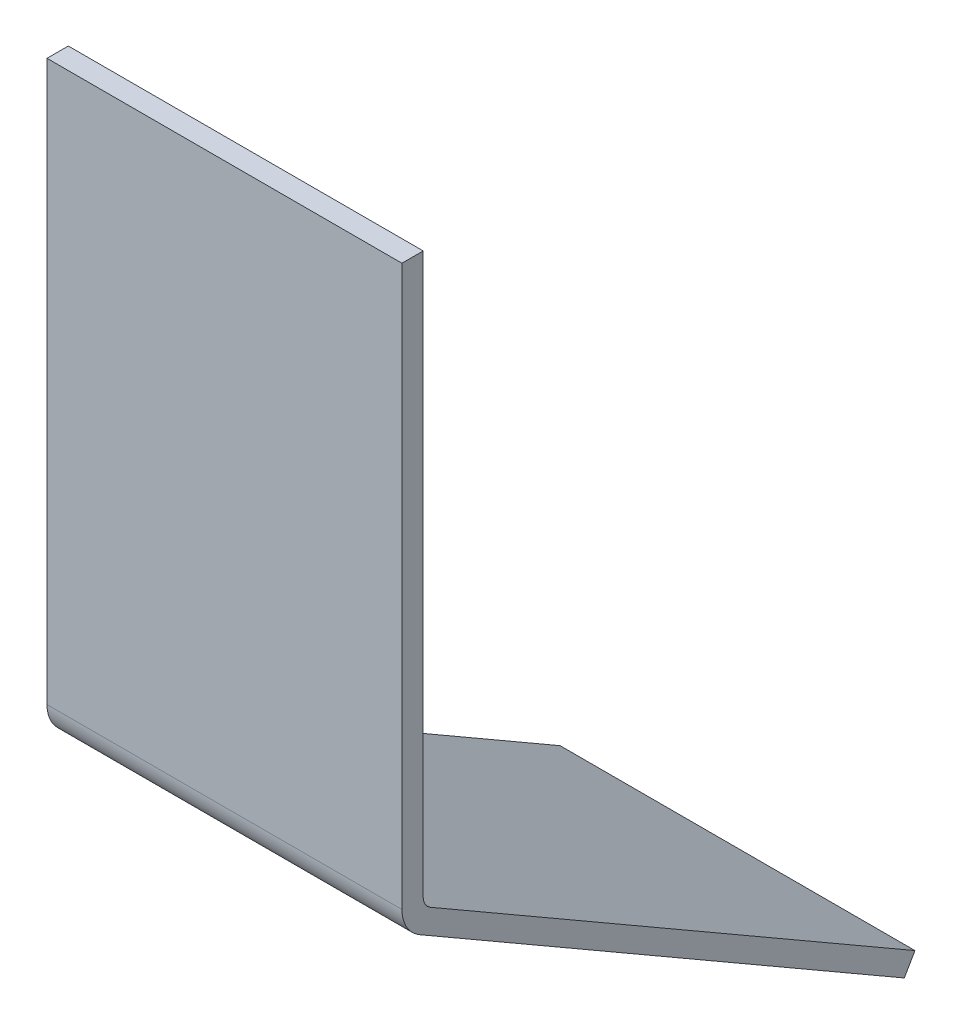
ISO-10303-21;
HEADER;
FILE_DESCRIPTION(('STEP AP214'),'2;1');
FILE_NAME('part.step','',(''),(''),'','','');
FILE_SCHEMA(('AUTOMOTIVE_DESIGN { 1 0 10303 214 1 1 1 1 }'));
ENDSEC;
DATA;
#1=APPLICATION_CONTEXT('core data for automotive mechanical design processes');
#2=APPLICATION_PROTOCOL_DEFINITION('international standard','automotive_design',2000,#1);
#3=PRODUCT_CONTEXT('',#1,'mechanical');
#4=PRODUCT('Part','Part','',(#3));
#5=PRODUCT_RELATED_PRODUCT_CATEGORY('part','',(#4));
#6=PRODUCT_DEFINITION_FORMATION('','',#4);
#7=PRODUCT_DEFINITION_CONTEXT('part definition',#1,'design');
#8=PRODUCT_DEFINITION('design','',#6,#7);
#9=PRODUCT_DEFINITION_SHAPE('','',#8);
#10=(LENGTH_UNIT() NAMED_UNIT(*) SI_UNIT(.MILLI.,.METRE.));
#11=(NAMED_UNIT(*) PLANE_ANGLE_UNIT() SI_UNIT($,.RADIAN.));
#12=(NAMED_UNIT(*) SI_UNIT($,.STERADIAN.) SOLID_ANGLE_UNIT());
#13=UNCERTAINTY_MEASURE_WITH_UNIT(LENGTH_MEASURE(1.E-05),#10,'distance_accuracy_value','');
#14=(GEOMETRIC_REPRESENTATION_CONTEXT(3) GLOBAL_UNCERTAINTY_ASSIGNED_CONTEXT((#13)) GLOBAL_UNIT_ASSIGNED_CONTEXT((#10,
#11,#12)) REPRESENTATION_CONTEXT('',''));
#15=CARTESIAN_POINT('',(0.,0.,0.));
#16=DIRECTION('',(0.,0.,1.));
#17=DIRECTION('',(1.,0.,0.));
#18=AXIS2_PLACEMENT_3D('',#15,#16,#17);
#19=CARTESIAN_POINT('',(25.,-3.17542648054294,0.499999999999997));
#20=DIRECTION('',(0.,0.86602540378444,-0.499999999999998));
#21=DIRECTION('',(0.,0.499999999999998,0.86602540378444));
#22=AXIS2_PLACEMENT_3D('',#19,#20,#21);
#23=PLANE('',#22);
#24=DIRECTION('',(0.,-0.499999999999998,-0.86602540378444));
#25=VECTOR('',#24,1.);
#26=CARTESIAN_POINT('',(-25.,-3.17542648054294,0.499999999999997));
#27=LINE('',#26,#25);
#28=CARTESIAN_POINT('',(-25.,-3.17542648054294,0.499999999999997));
#29=VERTEX_POINT('',#28);
#30=CARTESIAN_POINT('',(-25.,-42.5980762113531,-67.7820323027552));
#31=VERTEX_POINT('',#30);
#32=EDGE_CURVE('E136',#29,#31,#27,.T.);
#33=ORIENTED_EDGE('',*,*,#32,.T.);
#34=DIRECTION('',(-1.,0.,0.));
#35=VECTOR('',#34,1.);
#36=CARTESIAN_POINT('',(25.,-42.5980762113531,-67.7820323027552));
#37=LINE('',#36,#35);
#38=CARTESIAN_POINT('',(25.,-42.5980762113531,-67.7820323027552));
#39=VERTEX_POINT('',#38);
#40=EDGE_CURVE('E11',#39,#31,#37,.T.);
#41=ORIENTED_EDGE('',*,*,#40,.F.);
#42=DIRECTION('',(0.,-0.499999999999998,-0.86602540378444));
#43=VECTOR('',#42,1.);
#44=CARTESIAN_POINT('',(25.,-3.17542648054294,0.499999999999997));
#45=LINE('',#44,#43);
#46=CARTESIAN_POINT('',(25.,-3.17542648054294,0.499999999999997));
#47=VERTEX_POINT('',#46);
#48=EDGE_CURVE('E94',#47,#39,#45,.T.);
#49=ORIENTED_EDGE('',*,*,#48,.F.);
#50=DIRECTION('',(-1.,0.,0.));
#51=VECTOR('',#50,1.);
#52=CARTESIAN_POINT('',(25.,-3.17542648054294,0.499999999999997));
#53=LINE('',#52,#51);
#54=EDGE_CURVE('E135',#47,#29,#53,.T.);
#55=ORIENTED_EDGE('',*,*,#54,.T.);
#56=EDGE_LOOP('',(#33,#41,#49,#55));
#57=FACE_BOUND('',#56,.T.);
#58=ADVANCED_FACE('F39',(#57),#23,.F.);
#59=CARTESIAN_POINT('',(25.,-39.9999999999998,-69.2820323027552));
#60=DIRECTION('',(0.,-0.500000000000001,-0.866025403784438));
#61=DIRECTION('',(0.,0.866025403784438,-0.500000000000001));
#62=AXIS2_PLACEMENT_3D('',#59,#60,#61);
#63=PLANE('',#62);
#64=DIRECTION('',(0.,-0.866025403784438,0.500000000000001));
#65=VECTOR('',#64,1.);
#66=CARTESIAN_POINT('',(-25.,-39.9999999999998,-69.2820323027552));
#67=LINE('',#66,#65);
#68=CARTESIAN_POINT('',(-25.,-39.9999999999998,-69.2820323027552));
#69=VERTEX_POINT('',#68);
#70=EDGE_CURVE('E139',#69,#31,#67,.T.);
#71=ORIENTED_EDGE('',*,*,#70,.F.);
#72=DIRECTION('',(-1.,0.,0.));
#73=VECTOR('',#72,1.);
#74=CARTESIAN_POINT('',(25.,-39.9999999999998,-69.2820323027552));
#75=LINE('',#74,#73);
#76=CARTESIAN_POINT('',(25.,-39.9999999999998,-69.2820323027552));
#77=VERTEX_POINT('',#76);
#78=EDGE_CURVE('E47',#77,#69,#75,.T.);
#79=ORIENTED_EDGE('',*,*,#78,.F.);
#80=DIRECTION('',(0.,-0.866025403784438,0.500000000000001));
#81=VECTOR('',#80,1.);
#82=CARTESIAN_POINT('',(25.,-39.9999999999998,-69.2820323027552));
#83=LINE('',#82,#81);
#84=EDGE_CURVE('E178',#77,#39,#83,.T.);
#85=ORIENTED_EDGE('',*,*,#84,.T.);
#86=ORIENTED_EDGE('',*,*,#40,.T.);
#87=EDGE_LOOP('',(#71,#79,#85,#86));
#88=FACE_BOUND('',#87,.T.);
#89=ADVANCED_FACE('F169',(#88),#63,.T.);
#90=CARTESIAN_POINT('',(25.,-0.577350269189623,-0.999999999999996));
#91=DIRECTION('',(0.,0.86602540378444,-0.499999999999998));
#92=DIRECTION('',(0.,0.499999999999998,0.86602540378444));
#93=AXIS2_PLACEMENT_3D('',#90,#91,#92);
#94=PLANE('',#93);
#95=DIRECTION('',(0.,-0.499999999999998,-0.86602540378444));
#96=VECTOR('',#95,1.);
#97=CARTESIAN_POINT('',(-25.,-0.577350269189623,-0.999999999999996));
#98=LINE('',#97,#96);
#99=CARTESIAN_POINT('',(-25.,-0.577350269189624,-0.999999999999996));
#100=VERTEX_POINT('',#99);
#101=EDGE_CURVE('E142',#100,#69,#98,.T.);
#102=ORIENTED_EDGE('',*,*,#101,.F.);
#103=DIRECTION('',(-1.,0.,0.));
#104=VECTOR('',#103,1.);
#105=CARTESIAN_POINT('',(25.,-0.577350269189624,-0.999999999999996));
#106=LINE('',#105,#104);
#107=CARTESIAN_POINT('',(25.,-0.577350269189624,-0.999999999999996));
#108=VERTEX_POINT('',#107);
#109=EDGE_CURVE('E159',#108,#100,#106,.T.);
#110=ORIENTED_EDGE('',*,*,#109,.F.);
#111=DIRECTION('',(0.,-0.499999999999998,-0.86602540378444));
#112=VECTOR('',#111,1.);
#113=CARTESIAN_POINT('',(25.,-0.577350269189623,-0.999999999999996));
#114=LINE('',#113,#112);
#115=EDGE_CURVE('E166',#108,#77,#114,.T.);
#116=ORIENTED_EDGE('',*,*,#115,.T.);
#117=ORIENTED_EDGE('',*,*,#78,.T.);
#118=EDGE_LOOP('',(#102,#110,#116,#117));
#119=FACE_BOUND('',#118,.T.);
#120=ADVANCED_FACE('F164',(#119),#94,.T.);
#121=CARTESIAN_POINT('',(25.,1.15470053837926,-2.));
#122=DIRECTION('',(-1.,0.,0.));
#123=DIRECTION('',(0.,0.,1.));
#124=AXIS2_PLACEMENT_3D('',#121,#122,#123);
#125=CYLINDRICAL_SURFACE('',#124,2.);
#126=CARTESIAN_POINT('',(-25.,1.15470053837926,-2.));
#127=DIRECTION('',(1.,0.,0.));
#128=DIRECTION('',(0.,0.,-1.));
#129=AXIS2_PLACEMENT_3D('',#126,#127,#128);
#130=CIRCLE('',#129,2.);
#131=CARTESIAN_POINT('',(-25.,1.15470053837925,0.));
#132=VERTEX_POINT('',#131);
#133=EDGE_CURVE('E145',#132,#100,#130,.T.);
#134=ORIENTED_EDGE('',*,*,#133,.F.);
#135=DIRECTION('',(-1.,0.,0.));
#136=VECTOR('',#135,1.);
#137=CARTESIAN_POINT('',(25.,1.15470053837925,0.));
#138=LINE('',#137,#136);
#139=CARTESIAN_POINT('',(25.,1.15470053837925,0.));
#140=VERTEX_POINT('',#139);
#141=EDGE_CURVE('E157',#140,#132,#138,.T.);
#142=ORIENTED_EDGE('',*,*,#141,.F.);
#143=CARTESIAN_POINT('',(25.,1.15470053837926,-2.));
#144=DIRECTION('',(1.,0.,0.));
#145=DIRECTION('',(0.,0.,-1.));
#146=AXIS2_PLACEMENT_3D('',#143,#144,#145);
#147=CIRCLE('',#146,2.);
#148=EDGE_CURVE('E130',#140,#108,#147,.T.);
#149=ORIENTED_EDGE('',*,*,#148,.T.);
#150=ORIENTED_EDGE('',*,*,#109,.T.);
#151=EDGE_LOOP('',(#134,#142,#149,#150));
#152=FACE_BOUND('',#151,.T.);
#153=ADVANCED_FACE('F176',(#152),#125,.F.);
#154=CARTESIAN_POINT('',(25.,80.,0.));
#155=DIRECTION('',(0.,0.,-1.));
#156=DIRECTION('',(0.,1.,0.));
#157=AXIS2_PLACEMENT_3D('',#154,#155,#156);
#158=PLANE('',#157);
#159=DIRECTION('',(0.,-1.,0.));
#160=VECTOR('',#159,1.);
#161=CARTESIAN_POINT('',(-25.,80.,0.));
#162=LINE('',#161,#160);
#163=CARTESIAN_POINT('',(-25.,80.,0.));
#164=VERTEX_POINT('',#163);
#165=EDGE_CURVE('E148',#164,#132,#162,.T.);
#166=ORIENTED_EDGE('',*,*,#165,.F.);
#167=DIRECTION('',(-1.,0.,0.));
#168=VECTOR('',#167,1.);
#169=CARTESIAN_POINT('',(25.,80.,0.));
#170=LINE('',#169,#168);
#171=CARTESIAN_POINT('',(25.,80.,0.));
#172=VERTEX_POINT('',#171);
#173=EDGE_CURVE('E118',#172,#164,#170,.T.);
#174=ORIENTED_EDGE('',*,*,#173,.F.);
#175=DIRECTION('',(0.,-1.,0.));
#176=VECTOR('',#175,1.);
#177=CARTESIAN_POINT('',(25.,80.,0.));
#178=LINE('',#177,#176);
#179=EDGE_CURVE('E128',#172,#140,#178,.T.);
#180=ORIENTED_EDGE('',*,*,#179,.T.);
#181=ORIENTED_EDGE('',*,*,#141,.T.);
#182=EDGE_LOOP('',(#166,#174,#180,#181));
#183=FACE_BOUND('',#182,.T.);
#184=ADVANCED_FACE('F183',(#183),#158,.T.);
#185=CARTESIAN_POINT('',(25.,80.,3.));
#186=DIRECTION('',(0.,1.,0.));
#187=DIRECTION('',(0.,0.,1.));
#188=AXIS2_PLACEMENT_3D('',#185,#186,#187);
#189=PLANE('',#188);
#190=DIRECTION('',(0.,0.,-1.));
#191=VECTOR('',#190,1.);
#192=CARTESIAN_POINT('',(-25.,80.,3.));
#193=LINE('',#192,#191);
#194=CARTESIAN_POINT('',(-25.,80.,3.));
#195=VERTEX_POINT('',#194);
#196=EDGE_CURVE('E117',#195,#164,#193,.T.);
#197=ORIENTED_EDGE('',*,*,#196,.F.);
#198=DIRECTION('',(-1.,0.,0.));
#199=VECTOR('',#198,1.);
#200=CARTESIAN_POINT('',(25.,80.,3.));
#201=LINE('',#200,#199);
#202=CARTESIAN_POINT('',(25.,80.,3.));
#203=VERTEX_POINT('',#202);
#204=EDGE_CURVE('E111',#203,#195,#201,.T.);
#205=ORIENTED_EDGE('',*,*,#204,.F.);
#206=DIRECTION('',(0.,0.,-1.));
#207=VECTOR('',#206,1.);
#208=CARTESIAN_POINT('',(25.,80.,3.));
#209=LINE('',#208,#207);
#210=EDGE_CURVE('E115',#203,#172,#209,.T.);
#211=ORIENTED_EDGE('',*,*,#210,.T.);
#212=ORIENTED_EDGE('',*,*,#173,.T.);
#213=EDGE_LOOP('',(#197,#205,#211,#212));
#214=FACE_BOUND('',#213,.T.);
#215=ADVANCED_FACE('F113',(#214),#189,.T.);
#216=CARTESIAN_POINT('',(25.,80.,3.));
#217=DIRECTION('',(0.,0.,-1.));
#218=DIRECTION('',(0.,1.,0.));
#219=AXIS2_PLACEMENT_3D('',#216,#217,#218);
#220=PLANE('',#219);
#221=DIRECTION('',(0.,-1.,0.));
#222=VECTOR('',#221,1.);
#223=CARTESIAN_POINT('',(-25.,80.,3.));
#224=LINE('',#223,#222);
#225=CARTESIAN_POINT('',(-25.,1.15470053837925,3.));
#226=VERTEX_POINT('',#225);
#227=EDGE_CURVE('E82',#195,#226,#224,.T.);
#228=ORIENTED_EDGE('',*,*,#227,.T.);
#229=DIRECTION('',(-1.,0.,0.));
#230=VECTOR('',#229,1.);
#231=CARTESIAN_POINT('',(25.,1.15470053837925,3.));
#232=LINE('',#231,#230);
#233=CARTESIAN_POINT('',(25.,1.15470053837925,3.));
#234=VERTEX_POINT('',#233);
#235=EDGE_CURVE('E119',#234,#226,#232,.T.);
#236=ORIENTED_EDGE('',*,*,#235,.F.);
#237=DIRECTION('',(0.,-1.,0.));
#238=VECTOR('',#237,1.);
#239=CARTESIAN_POINT('',(25.,80.,3.));
#240=LINE('',#239,#238);
#241=EDGE_CURVE('E121',#203,#234,#240,.T.);
#242=ORIENTED_EDGE('',*,*,#241,.F.);
#243=ORIENTED_EDGE('',*,*,#204,.T.);
#244=EDGE_LOOP('',(#228,#236,#242,#243));
#245=FACE_BOUND('',#244,.T.);
#246=ADVANCED_FACE('F122',(#245),#220,.F.);
#247=CARTESIAN_POINT('',(25.,1.15470053837926,-2.));
#248=DIRECTION('',(-1.,0.,0.));
#249=DIRECTION('',(0.,0.,1.));
#250=AXIS2_PLACEMENT_3D('',#247,#248,#249);
#251=CYLINDRICAL_SURFACE('',#250,5.);
#252=CARTESIAN_POINT('',(-25.,1.15470053837926,-2.));
#253=DIRECTION('',(1.,0.,0.));
#254=DIRECTION('',(0.,0.,-1.));
#255=AXIS2_PLACEMENT_3D('',#252,#253,#254);
#256=CIRCLE('',#255,5.);
#257=EDGE_CURVE('E88',#226,#29,#256,.T.);
#258=ORIENTED_EDGE('',*,*,#257,.T.);
#259=ORIENTED_EDGE('',*,*,#54,.F.);
#260=CARTESIAN_POINT('',(25.,1.15470053837926,-2.));
#261=DIRECTION('',(1.,0.,0.));
#262=DIRECTION('',(0.,0.,-1.));
#263=AXIS2_PLACEMENT_3D('',#260,#261,#262);
#264=CIRCLE('',#263,5.);
#265=EDGE_CURVE('E55',#234,#47,#264,.T.);
#266=ORIENTED_EDGE('',*,*,#265,.F.);
#267=ORIENTED_EDGE('',*,*,#235,.T.);
#268=EDGE_LOOP('',(#258,#259,#266,#267));
#269=FACE_BOUND('',#268,.T.);
#270=ADVANCED_FACE('F185',(#269),#251,.T.);
#271=CARTESIAN_POINT('',(25.,1.15470053837926,-2.));
#272=DIRECTION('',(1.,0.,0.));
#273=DIRECTION('',(0.,0.,-1.));
#274=AXIS2_PLACEMENT_3D('',#271,#272,#273);
#275=PLANE('',#274);
#276=ORIENTED_EDGE('',*,*,#48,.T.);
#277=ORIENTED_EDGE('',*,*,#84,.F.);
#278=ORIENTED_EDGE('',*,*,#115,.F.);
#279=ORIENTED_EDGE('',*,*,#148,.F.);
#280=ORIENTED_EDGE('',*,*,#179,.F.);
#281=ORIENTED_EDGE('',*,*,#210,.F.);
#282=ORIENTED_EDGE('',*,*,#241,.T.);
#283=ORIENTED_EDGE('',*,*,#265,.T.);
#284=EDGE_LOOP('',(#276,#277,#278,#279,#280,#281,#282,#283));
#285=FACE_BOUND('',#284,.T.);
#286=ADVANCED_FACE('F125',(#285),#275,.T.);
#287=CARTESIAN_POINT('',(-25.,1.15470053837926,-2.));
#288=DIRECTION('',(1.,0.,0.));
#289=DIRECTION('',(0.,0.,-1.));
#290=AXIS2_PLACEMENT_3D('',#287,#288,#289);
#291=PLANE('',#290);
#292=ORIENTED_EDGE('',*,*,#32,.F.);
#293=ORIENTED_EDGE('',*,*,#257,.F.);
#294=ORIENTED_EDGE('',*,*,#227,.F.);
#295=ORIENTED_EDGE('',*,*,#196,.T.);
#296=ORIENTED_EDGE('',*,*,#165,.T.);
#297=ORIENTED_EDGE('',*,*,#133,.T.);
#298=ORIENTED_EDGE('',*,*,#101,.T.);
#299=ORIENTED_EDGE('',*,*,#70,.T.);
#300=EDGE_LOOP('',(#292,#293,#294,#295,#296,#297,#298,#299));
#301=FACE_BOUND('',#300,.T.);
#302=ADVANCED_FACE('F172',(#301),#291,.F.);
#303=CLOSED_SHELL('',(#58,#89,#120,#153,#184,#215,#246,#270,#286,#302));
#304=MANIFOLD_SOLID_BREP('B2',#303);
#305=ADVANCED_BREP_SHAPE_REPRESENTATION('',(#18,#304),#14);
#306=SHAPE_DEFINITION_REPRESENTATION(#9,#305);
ENDSEC;
END-ISO-10303-21;
